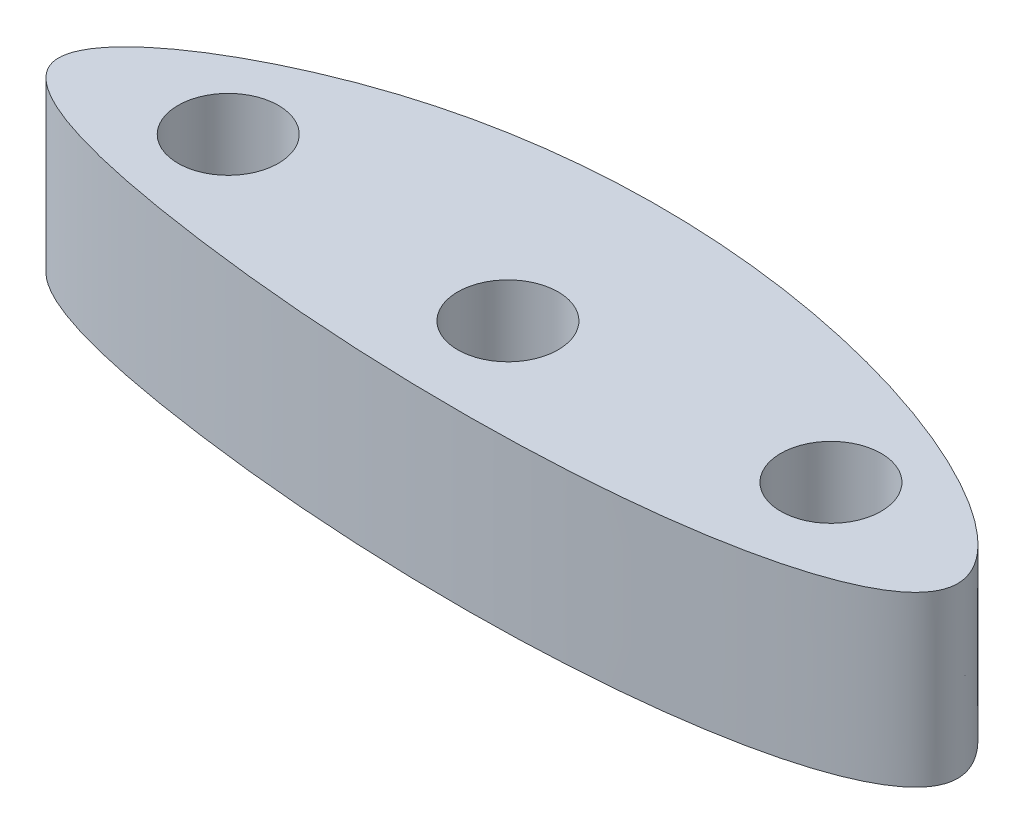
ISO-10303-21;
HEADER;
FILE_DESCRIPTION(('STEP AP214'),'2;1');
FILE_NAME('part.step','',(''),(''),'','','');
FILE_SCHEMA(('AUTOMOTIVE_DESIGN { 1 0 10303 214 1 1 1 1 }'));
ENDSEC;
DATA;
#1=APPLICATION_CONTEXT('core data for automotive mechanical design processes');
#2=APPLICATION_PROTOCOL_DEFINITION('international standard','automotive_design',2000,#1);
#3=PRODUCT_CONTEXT('',#1,'mechanical');
#4=PRODUCT('Part','Part','',(#3));
#5=PRODUCT_RELATED_PRODUCT_CATEGORY('part','',(#4));
#6=PRODUCT_DEFINITION_FORMATION('','',#4);
#7=PRODUCT_DEFINITION_CONTEXT('part definition',#1,'design');
#8=PRODUCT_DEFINITION('design','',#6,#7);
#9=PRODUCT_DEFINITION_SHAPE('','',#8);
#10=(LENGTH_UNIT() NAMED_UNIT(*) SI_UNIT(.MILLI.,.METRE.));
#11=(NAMED_UNIT(*) PLANE_ANGLE_UNIT() SI_UNIT($,.RADIAN.));
#12=(NAMED_UNIT(*) SI_UNIT($,.STERADIAN.) SOLID_ANGLE_UNIT());
#13=UNCERTAINTY_MEASURE_WITH_UNIT(LENGTH_MEASURE(1.E-05),#10,'distance_accuracy_value','');
#14=(GEOMETRIC_REPRESENTATION_CONTEXT(3) GLOBAL_UNCERTAINTY_ASSIGNED_CONTEXT((#13)) GLOBAL_UNIT_ASSIGNED_CONTEXT((#10,
#11,#12)) REPRESENTATION_CONTEXT('',''));
#15=CARTESIAN_POINT('',(0.,0.,0.));
#16=DIRECTION('',(0.,0.,1.));
#17=DIRECTION('',(1.,0.,0.));
#18=AXIS2_PLACEMENT_3D('',#15,#16,#17);
#19=CARTESIAN_POINT('',(34.7144301683943,8.4,-0.429088161329914));
#20=DIRECTION('',(0.,1.,0.));
#21=DIRECTION('',(0.,0.,1.));
#22=AXIS2_PLACEMENT_3D('',#19,#20,#21);
#23=PLANE('',#22);
#24=CARTESIAN_POINT('',(12.2418134366345,8.4,-0.164766664062107));
#25=DIRECTION('',(0.,1.,0.));
#26=DIRECTION('',(0.,0.,1.));
#27=AXIS2_PLACEMENT_3D('',#24,#25,#26);
#28=CIRCLE('',#27,2.5);
#29=CARTESIAN_POINT('',(12.2418134366345,8.39999999999999,-2.66476666406211));
#30=VERTEX_POINT('',#29);
#31=EDGE_CURVE('E55',#30,#30,#28,.T.);
#32=ORIENTED_EDGE('',*,*,#31,.F.);
#33=EDGE_LOOP('',(#32));
#34=FACE_BOUND('',#33,.T.);
#35=CARTESIAN_POINT('',(-10.2403549052846,8.4,0.));
#36=CARTESIAN_POINT('',(-9.7901955701614,8.4,1.9523160760497));
#37=CARTESIAN_POINT('',(10.2205359397792,8.4,6.78554685382735));
#38=CARTESIAN_POINT('',(53.6020693336113,8.4,2.82363610312065));
#39=CARTESIAN_POINT('',(9.0457901157086,8.4,-14.8561358803526));
#40=CARTESIAN_POINT('',(-10.7571119248499,8.4,-2.24114654077513));
#41=CARTESIAN_POINT('',(-10.2403549052846,8.4,0.));
#42=B_SPLINE_CURVE_WITH_KNOTS('',3,(#35,#36,#37,#38,#39,#40,#41),.UNSPECIFIED.,.T.,.F.,(4,1,1,1,
4),(0.,0.116417381422337,0.48851706440724,0.866359543487093,1.),.UNSPECIFIED.);
#43=CARTESIAN_POINT('',(-10.2403549052846,8.4,0.));
#44=VERTEX_POINT('',#43);
#45=EDGE_CURVE('E10',#44,#44,#42,.T.);
#46=ORIENTED_EDGE('',*,*,#45,.T.);
#47=EDGE_LOOP('',(#46));
#48=FACE_BOUND('',#47,.T.);
#49=CARTESIAN_POINT('',(-2.75818656336549,8.4,-1.24268851227782));
#50=DIRECTION('',(0.,1.,0.));
#51=DIRECTION('',(0.,0.,1.));
#52=AXIS2_PLACEMENT_3D('',#49,#50,#51);
#53=CIRCLE('',#52,2.5);
#54=CARTESIAN_POINT('',(-2.75818656336549,8.39999999999999,-3.74268851227782));
#55=VERTEX_POINT('',#54);
#56=EDGE_CURVE('E44',#55,#55,#53,.T.);
#57=ORIENTED_EDGE('',*,*,#56,.F.);
#58=EDGE_LOOP('',(#57));
#59=FACE_BOUND('',#58,.T.);
#60=CARTESIAN_POINT('',(27.2418134366345,8.4,-1.24268851227782));
#61=DIRECTION('',(0.,1.,0.));
#62=DIRECTION('',(0.,0.,1.));
#63=AXIS2_PLACEMENT_3D('',#60,#61,#62);
#64=CIRCLE('',#63,2.5);
#65=CARTESIAN_POINT('',(27.2418134366345,8.39999999999999,-3.74268851227783));
#66=VERTEX_POINT('',#65);
#67=EDGE_CURVE('E61',#66,#66,#64,.T.);
#68=ORIENTED_EDGE('',*,*,#67,.F.);
#69=EDGE_LOOP('',(#68));
#70=FACE_BOUND('',#69,.T.);
#71=ADVANCED_FACE('F31',(#34,#48,#59,#70),#23,.T.);
#72=CARTESIAN_POINT('',(34.7144301683943,0.,-0.429088161329914));
#73=DIRECTION('',(0.,1.,0.));
#74=DIRECTION('',(0.,0.,1.));
#75=AXIS2_PLACEMENT_3D('',#72,#73,#74);
#76=PLANE('',#75);
#77=CARTESIAN_POINT('',(-10.2403549052846,0.,0.));
#78=CARTESIAN_POINT('',(-9.7901955701614,0.,1.9523160760497));
#79=CARTESIAN_POINT('',(10.2205359397792,0.,6.78554685382735));
#80=CARTESIAN_POINT('',(53.6020693336113,0.,2.82363610312065));
#81=CARTESIAN_POINT('',(9.0457901157086,0.,-14.8561358803526));
#82=CARTESIAN_POINT('',(-10.7571119248499,0.,-2.24114654077513));
#83=CARTESIAN_POINT('',(-10.2403549052846,0.,0.));
#84=B_SPLINE_CURVE_WITH_KNOTS('',3,(#77,#78,#79,#80,#81,#82,#83),.UNSPECIFIED.,.T.,.F.,(4,1,1,1,
4),(0.,0.116417381422337,0.48851706440724,0.866359543487093,1.),.UNSPECIFIED.);
#85=CARTESIAN_POINT('',(-10.2403549052846,0.,0.));
#86=VERTEX_POINT('',#85);
#87=EDGE_CURVE('E36',#86,#86,#84,.T.);
#88=ORIENTED_EDGE('',*,*,#87,.F.);
#89=EDGE_LOOP('',(#88));
#90=FACE_BOUND('',#89,.T.);
#91=CARTESIAN_POINT('',(-2.75818656336549,0.,-1.24268851227782));
#92=DIRECTION('',(0.,1.,0.));
#93=DIRECTION('',(0.,0.,1.));
#94=AXIS2_PLACEMENT_3D('',#91,#92,#93);
#95=CIRCLE('',#94,2.5);
#96=CARTESIAN_POINT('',(-2.75818656336549,0.,-3.74268851227782));
#97=VERTEX_POINT('',#96);
#98=EDGE_CURVE('E49',#97,#97,#95,.T.);
#99=ORIENTED_EDGE('',*,*,#98,.T.);
#100=EDGE_LOOP('',(#99));
#101=FACE_BOUND('',#100,.T.);
#102=CARTESIAN_POINT('',(12.2418134366345,0.,-0.164766664062107));
#103=DIRECTION('',(0.,1.,0.));
#104=DIRECTION('',(0.,0.,1.));
#105=AXIS2_PLACEMENT_3D('',#102,#103,#104);
#106=CIRCLE('',#105,2.5);
#107=CARTESIAN_POINT('',(12.2418134366345,0.,-2.66476666406211));
#108=VERTEX_POINT('',#107);
#109=EDGE_CURVE('E58',#108,#108,#106,.T.);
#110=ORIENTED_EDGE('',*,*,#109,.T.);
#111=EDGE_LOOP('',(#110));
#112=FACE_BOUND('',#111,.T.);
#113=CARTESIAN_POINT('',(27.2418134366345,0.,-1.24268851227782));
#114=DIRECTION('',(0.,1.,0.));
#115=DIRECTION('',(0.,0.,1.));
#116=AXIS2_PLACEMENT_3D('',#113,#114,#115);
#117=CIRCLE('',#116,2.5);
#118=CARTESIAN_POINT('',(27.2418134366345,0.,-3.74268851227783));
#119=VERTEX_POINT('',#118);
#120=EDGE_CURVE('E64',#119,#119,#117,.T.);
#121=ORIENTED_EDGE('',*,*,#120,.T.);
#122=EDGE_LOOP('',(#121));
#123=FACE_BOUND('',#122,.T.);
#124=ADVANCED_FACE('F74',(#90,#101,#112,#123),#76,.F.);
#125=DIRECTION('',(0.,-1.,0.));
#126=VECTOR('',#125,1.);
#127=SURFACE_OF_LINEAR_EXTRUSION('',#42,#126);
#128=ORIENTED_EDGE('',*,*,#45,.F.);
#129=EDGE_LOOP('',(#128));
#130=FACE_BOUND('',#129,.T.);
#131=ORIENTED_EDGE('',*,*,#87,.T.);
#132=EDGE_LOOP('',(#131));
#133=FACE_BOUND('',#132,.T.);
#134=ADVANCED_FACE('F33',(#130,#133),#127,.F.);
#135=CARTESIAN_POINT('',(-2.75818656336549,8.4,-1.24268851227782));
#136=DIRECTION('',(0.,-1.,0.));
#137=DIRECTION('',(0.,0.,-1.));
#138=AXIS2_PLACEMENT_3D('',#135,#136,#137);
#139=CYLINDRICAL_SURFACE('',#138,2.5);
#140=CARTESIAN_POINT('',(-2.75818656336549,8.39999999999999,-3.74268851227782));
#141=CARTESIAN_POINT('',(-2.75818656336549,8.31249999999999,-3.74268851227782));
#142=CARTESIAN_POINT('',(-2.75818656336549,8.22499999999999,-3.74268851227782));
#143=CARTESIAN_POINT('',(-2.75818656336549,8.04999999999999,-3.74268851227782));
#144=CARTESIAN_POINT('',(-2.75818656336549,7.96249999999999,-3.74268851227782));
#145=CARTESIAN_POINT('',(-2.75818656336549,7.78749999999999,-3.74268851227782));
#146=CARTESIAN_POINT('',(-2.75818656336549,7.69999999999999,-3.74268851227782));
#147=CARTESIAN_POINT('',(-2.75818656336549,7.52499999999999,-3.74268851227782));
#148=CARTESIAN_POINT('',(-2.75818656336549,7.43749999999999,-3.74268851227782));
#149=CARTESIAN_POINT('',(-2.75818656336549,7.26249999999999,-3.74268851227782));
#150=CARTESIAN_POINT('',(-2.75818656336549,7.17499999999999,-3.74268851227782));
#151=CARTESIAN_POINT('',(-2.75818656336549,6.99999999999999,-3.74268851227782));
#152=CARTESIAN_POINT('',(-2.75818656336549,6.91249999999999,-3.74268851227782));
#153=CARTESIAN_POINT('',(-2.75818656336549,6.73749999999999,-3.74268851227782));
#154=CARTESIAN_POINT('',(-2.75818656336549,6.64999999999999,-3.74268851227782));
#155=CARTESIAN_POINT('',(-2.75818656336549,6.47499999999999,-3.74268851227782));
#156=CARTESIAN_POINT('',(-2.75818656336549,6.38749999999999,-3.74268851227782));
#157=CARTESIAN_POINT('',(-2.75818656336549,6.2125,-3.74268851227782));
#158=CARTESIAN_POINT('',(-2.75818656336549,6.12499999999999,-3.74268851227782));
#159=CARTESIAN_POINT('',(-2.75818656336549,5.94999999999999,-3.74268851227782));
#160=CARTESIAN_POINT('',(-2.75818656336549,5.8625,-3.74268851227782));
#161=CARTESIAN_POINT('',(-2.75818656336549,5.6875,-3.74268851227782));
#162=CARTESIAN_POINT('',(-2.75818656336549,5.59999999999999,-3.74268851227782));
#163=CARTESIAN_POINT('',(-2.75818656336549,5.42499999999999,-3.74268851227782));
#164=CARTESIAN_POINT('',(-2.75818656336549,5.3375,-3.74268851227782));
#165=CARTESIAN_POINT('',(-2.75818656336549,5.1625,-3.74268851227782));
#166=CARTESIAN_POINT('',(-2.75818656336549,5.075,-3.74268851227782));
#167=CARTESIAN_POINT('',(-2.75818656336549,4.9,-3.74268851227782));
#168=CARTESIAN_POINT('',(-2.75818656336549,4.8125,-3.74268851227782));
#169=CARTESIAN_POINT('',(-2.75818656336549,4.6375,-3.74268851227782));
#170=CARTESIAN_POINT('',(-2.75818656336549,4.55,-3.74268851227782));
#171=CARTESIAN_POINT('',(-2.75818656336549,4.375,-3.74268851227782));
#172=CARTESIAN_POINT('',(-2.75818656336549,4.2875,-3.74268851227782));
#173=CARTESIAN_POINT('',(-2.75818656336549,4.1125,-3.74268851227782));
#174=CARTESIAN_POINT('',(-2.75818656336549,4.025,-3.74268851227782));
#175=CARTESIAN_POINT('',(-2.75818656336549,3.85,-3.74268851227782));
#176=CARTESIAN_POINT('',(-2.75818656336549,3.7625,-3.74268851227782));
#177=CARTESIAN_POINT('',(-2.75818656336549,3.5875,-3.74268851227782));
#178=CARTESIAN_POINT('',(-2.75818656336549,3.5,-3.74268851227782));
#179=CARTESIAN_POINT('',(-2.75818656336549,3.325,-3.74268851227782));
#180=CARTESIAN_POINT('',(-2.75818656336549,3.2375,-3.74268851227782));
#181=CARTESIAN_POINT('',(-2.75818656336549,3.0625,-3.74268851227782));
#182=CARTESIAN_POINT('',(-2.75818656336549,2.975,-3.74268851227782));
#183=CARTESIAN_POINT('',(-2.75818656336549,2.8,-3.74268851227782));
#184=CARTESIAN_POINT('',(-2.75818656336549,2.7125,-3.74268851227782));
#185=CARTESIAN_POINT('',(-2.75818656336549,2.5375,-3.74268851227782));
#186=CARTESIAN_POINT('',(-2.75818656336549,2.45,-3.74268851227782));
#187=CARTESIAN_POINT('',(-2.75818656336549,2.275,-3.74268851227782));
#188=CARTESIAN_POINT('',(-2.75818656336549,2.1875,-3.74268851227782));
#189=CARTESIAN_POINT('',(-2.75818656336549,2.0125,-3.74268851227782));
#190=CARTESIAN_POINT('',(-2.75818656336549,1.925,-3.74268851227782));
#191=CARTESIAN_POINT('',(-2.75818656336549,1.75,-3.74268851227782));
#192=CARTESIAN_POINT('',(-2.75818656336549,1.6625,-3.74268851227782));
#193=CARTESIAN_POINT('',(-2.75818656336549,1.4875,-3.74268851227782));
#194=CARTESIAN_POINT('',(-2.75818656336549,1.4,-3.74268851227782));
#195=CARTESIAN_POINT('',(-2.75818656336549,1.225,-3.74268851227782));
#196=CARTESIAN_POINT('',(-2.75818656336549,1.1375,-3.74268851227782));
#197=CARTESIAN_POINT('',(-2.75818656336549,0.962499999999998,-3.74268851227782));
#198=CARTESIAN_POINT('',(-2.75818656336549,0.874999999999998,-3.74268851227782));
#199=CARTESIAN_POINT('',(-2.75818656336549,0.699999999999998,-3.74268851227782));
#200=CARTESIAN_POINT('',(-2.75818656336549,0.612499999999998,-3.74268851227782));
#201=CARTESIAN_POINT('',(-2.75818656336549,0.437499999999998,-3.74268851227782));
#202=CARTESIAN_POINT('',(-2.75818656336549,0.349999999999998,-3.74268851227782));
#203=CARTESIAN_POINT('',(-2.75818656336549,0.174999999999999,-3.74268851227782));
#204=CARTESIAN_POINT('',(-2.75818656336549,0.0874999999999985,-3.74268851227782));
#205=CARTESIAN_POINT('',(-2.75818656336549,0.,-3.74268851227782));
#206=B_SPLINE_CURVE_WITH_KNOTS('',3,(#140,#141,#142,#143,#144,#145,#146,#147,#148,#149,#150,
#151,#152,#153,#154,#155,#156,#157,#158,#159,#160,#161,#162,#163,#164,#165,#166,#167,#168,#169,
#170,#171,#172,#173,#174,#175,#176,#177,#178,#179,#180,#181,#182,#183,#184,#185,#186,#187,#188,
#189,#190,#191,#192,#193,#194,#195,#196,#197,#198,#199,#200,#201,#202,#203,#204,#205),
.UNSPECIFIED.,.F.,.F.,(4,2,2,2,2,2,2,2,2,2,2,2,2,2,2,2,2,2,2,2,2,2,2,2,2,2,2,2,2,2,2,2,4),(0.,
0.262499999999999,0.524999999999999,0.787499999999998,1.05,1.3125,1.575,1.8375,2.1,2.3625,2.625,
2.8875,3.15,3.4125,3.675,3.9375,4.2,4.4625,4.725,4.9875,5.25,5.5125,5.775,6.0375,
6.29999999999999,6.5625,6.82499999999999,7.0875,7.34999999999999,7.61249999999999,
7.87499999999999,8.13749999999999,8.4),.UNSPECIFIED.);
#207=EDGE_CURVE('BSEAM83',#55,#97,#206,.T.);
#208=ORIENTED_EDGE('',*,*,#56,.T.);
#209=ORIENTED_EDGE('',*,*,#98,.F.);
#210=ORIENTED_EDGE('',*,*,#207,.T.);
#211=ORIENTED_EDGE('',*,*,#207,.F.);
#212=EDGE_LOOP('',(#208,#210,#209,#211));
#213=FACE_BOUND('',#212,.T.);
#214=ADVANCED_FACE('F83',(#213),#139,.F.);
#215=CARTESIAN_POINT('',(12.2418134366345,8.4,-0.164766664062107));
#216=DIRECTION('',(0.,-1.,0.));
#217=DIRECTION('',(0.,0.,-1.));
#218=AXIS2_PLACEMENT_3D('',#215,#216,#217);
#219=CYLINDRICAL_SURFACE('',#218,2.5);
#220=CARTESIAN_POINT('',(12.2418134366345,8.39999999999999,-2.66476666406211));
#221=CARTESIAN_POINT('',(12.2418134366345,8.31249999999999,-2.66476666406211));
#222=CARTESIAN_POINT('',(12.2418134366345,8.22499999999999,-2.66476666406211));
#223=CARTESIAN_POINT('',(12.2418134366345,8.04999999999999,-2.66476666406211));
#224=CARTESIAN_POINT('',(12.2418134366345,7.96249999999999,-2.66476666406211));
#225=CARTESIAN_POINT('',(12.2418134366345,7.78749999999999,-2.66476666406211));
#226=CARTESIAN_POINT('',(12.2418134366345,7.69999999999999,-2.66476666406211));
#227=CARTESIAN_POINT('',(12.2418134366345,7.52499999999999,-2.66476666406211));
#228=CARTESIAN_POINT('',(12.2418134366345,7.43749999999999,-2.66476666406211));
#229=CARTESIAN_POINT('',(12.2418134366345,7.26249999999999,-2.66476666406211));
#230=CARTESIAN_POINT('',(12.2418134366345,7.17499999999999,-2.66476666406211));
#231=CARTESIAN_POINT('',(12.2418134366345,6.99999999999999,-2.66476666406211));
#232=CARTESIAN_POINT('',(12.2418134366345,6.91249999999999,-2.66476666406211));
#233=CARTESIAN_POINT('',(12.2418134366345,6.73749999999999,-2.66476666406211));
#234=CARTESIAN_POINT('',(12.2418134366345,6.64999999999999,-2.66476666406211));
#235=CARTESIAN_POINT('',(12.2418134366345,6.47499999999999,-2.66476666406211));
#236=CARTESIAN_POINT('',(12.2418134366345,6.38749999999999,-2.66476666406211));
#237=CARTESIAN_POINT('',(12.2418134366345,6.2125,-2.66476666406211));
#238=CARTESIAN_POINT('',(12.2418134366345,6.12499999999999,-2.66476666406211));
#239=CARTESIAN_POINT('',(12.2418134366345,5.94999999999999,-2.66476666406211));
#240=CARTESIAN_POINT('',(12.2418134366345,5.8625,-2.66476666406211));
#241=CARTESIAN_POINT('',(12.2418134366345,5.6875,-2.66476666406211));
#242=CARTESIAN_POINT('',(12.2418134366345,5.59999999999999,-2.66476666406211));
#243=CARTESIAN_POINT('',(12.2418134366345,5.42499999999999,-2.66476666406211));
#244=CARTESIAN_POINT('',(12.2418134366345,5.3375,-2.66476666406211));
#245=CARTESIAN_POINT('',(12.2418134366345,5.1625,-2.66476666406211));
#246=CARTESIAN_POINT('',(12.2418134366345,5.075,-2.66476666406211));
#247=CARTESIAN_POINT('',(12.2418134366345,4.9,-2.66476666406211));
#248=CARTESIAN_POINT('',(12.2418134366345,4.8125,-2.66476666406211));
#249=CARTESIAN_POINT('',(12.2418134366345,4.6375,-2.66476666406211));
#250=CARTESIAN_POINT('',(12.2418134366345,4.55,-2.66476666406211));
#251=CARTESIAN_POINT('',(12.2418134366345,4.375,-2.66476666406211));
#252=CARTESIAN_POINT('',(12.2418134366345,4.2875,-2.66476666406211));
#253=CARTESIAN_POINT('',(12.2418134366345,4.1125,-2.66476666406211));
#254=CARTESIAN_POINT('',(12.2418134366345,4.025,-2.66476666406211));
#255=CARTESIAN_POINT('',(12.2418134366345,3.85,-2.66476666406211));
#256=CARTESIAN_POINT('',(12.2418134366345,3.7625,-2.66476666406211));
#257=CARTESIAN_POINT('',(12.2418134366345,3.5875,-2.66476666406211));
#258=CARTESIAN_POINT('',(12.2418134366345,3.5,-2.66476666406211));
#259=CARTESIAN_POINT('',(12.2418134366345,3.325,-2.66476666406211));
#260=CARTESIAN_POINT('',(12.2418134366345,3.2375,-2.66476666406211));
#261=CARTESIAN_POINT('',(12.2418134366345,3.0625,-2.66476666406211));
#262=CARTESIAN_POINT('',(12.2418134366345,2.975,-2.66476666406211));
#263=CARTESIAN_POINT('',(12.2418134366345,2.8,-2.66476666406211));
#264=CARTESIAN_POINT('',(12.2418134366345,2.7125,-2.66476666406211));
#265=CARTESIAN_POINT('',(12.2418134366345,2.5375,-2.66476666406211));
#266=CARTESIAN_POINT('',(12.2418134366345,2.45,-2.66476666406211));
#267=CARTESIAN_POINT('',(12.2418134366345,2.275,-2.66476666406211));
#268=CARTESIAN_POINT('',(12.2418134366345,2.1875,-2.66476666406211));
#269=CARTESIAN_POINT('',(12.2418134366345,2.0125,-2.66476666406211));
#270=CARTESIAN_POINT('',(12.2418134366345,1.925,-2.66476666406211));
#271=CARTESIAN_POINT('',(12.2418134366345,1.75,-2.66476666406211));
#272=CARTESIAN_POINT('',(12.2418134366345,1.6625,-2.66476666406211));
#273=CARTESIAN_POINT('',(12.2418134366345,1.4875,-2.66476666406211));
#274=CARTESIAN_POINT('',(12.2418134366345,1.4,-2.66476666406211));
#275=CARTESIAN_POINT('',(12.2418134366345,1.225,-2.66476666406211));
#276=CARTESIAN_POINT('',(12.2418134366345,1.1375,-2.66476666406211));
#277=CARTESIAN_POINT('',(12.2418134366345,0.962499999999998,-2.66476666406211));
#278=CARTESIAN_POINT('',(12.2418134366345,0.874999999999998,-2.66476666406211));
#279=CARTESIAN_POINT('',(12.2418134366345,0.699999999999998,-2.66476666406211));
#280=CARTESIAN_POINT('',(12.2418134366345,0.612499999999998,-2.66476666406211));
#281=CARTESIAN_POINT('',(12.2418134366345,0.437499999999998,-2.66476666406211));
#282=CARTESIAN_POINT('',(12.2418134366345,0.349999999999998,-2.66476666406211));
#283=CARTESIAN_POINT('',(12.2418134366345,0.174999999999999,-2.66476666406211));
#284=CARTESIAN_POINT('',(12.2418134366345,0.0874999999999985,-2.66476666406211));
#285=CARTESIAN_POINT('',(12.2418134366345,0.,-2.66476666406211));
#286=B_SPLINE_CURVE_WITH_KNOTS('',3,(#220,#221,#222,#223,#224,#225,#226,#227,#228,#229,#230,
#231,#232,#233,#234,#235,#236,#237,#238,#239,#240,#241,#242,#243,#244,#245,#246,#247,#248,#249,
#250,#251,#252,#253,#254,#255,#256,#257,#258,#259,#260,#261,#262,#263,#264,#265,#266,#267,#268,
#269,#270,#271,#272,#273,#274,#275,#276,#277,#278,#279,#280,#281,#282,#283,#284,#285),
.UNSPECIFIED.,.F.,.F.,(4,2,2,2,2,2,2,2,2,2,2,2,2,2,2,2,2,2,2,2,2,2,2,2,2,2,2,2,2,2,2,2,4),(0.,
0.262499999999999,0.524999999999999,0.787499999999998,1.05,1.3125,1.575,1.8375,2.1,2.3625,2.625,
2.8875,3.15,3.4125,3.675,3.9375,4.2,4.4625,4.725,4.9875,5.25,5.5125,5.775,6.0375,
6.29999999999999,6.5625,6.82499999999999,7.0875,7.34999999999999,7.61249999999999,
7.87499999999999,8.13749999999999,8.4),.UNSPECIFIED.);
#287=EDGE_CURVE('BSEAM86',#30,#108,#286,.T.);
#288=ORIENTED_EDGE('',*,*,#31,.T.);
#289=ORIENTED_EDGE('',*,*,#109,.F.);
#290=ORIENTED_EDGE('',*,*,#287,.T.);
#291=ORIENTED_EDGE('',*,*,#287,.F.);
#292=EDGE_LOOP('',(#288,#290,#289,#291));
#293=FACE_BOUND('',#292,.T.);
#294=ADVANCED_FACE('F86',(#293),#219,.F.);
#295=CARTESIAN_POINT('',(27.2418134366345,8.4,-1.24268851227782));
#296=DIRECTION('',(0.,-1.,0.));
#297=DIRECTION('',(0.,0.,-1.));
#298=AXIS2_PLACEMENT_3D('',#295,#296,#297);
#299=CYLINDRICAL_SURFACE('',#298,2.5);
#300=CARTESIAN_POINT('',(27.2418134366345,8.39999999999999,-3.74268851227783));
#301=CARTESIAN_POINT('',(27.2418134366345,8.31249999999999,-3.74268851227783));
#302=CARTESIAN_POINT('',(27.2418134366345,8.22499999999999,-3.74268851227783));
#303=CARTESIAN_POINT('',(27.2418134366345,8.04999999999999,-3.74268851227783));
#304=CARTESIAN_POINT('',(27.2418134366345,7.96249999999999,-3.74268851227783));
#305=CARTESIAN_POINT('',(27.2418134366345,7.78749999999999,-3.74268851227783));
#306=CARTESIAN_POINT('',(27.2418134366345,7.69999999999999,-3.74268851227783));
#307=CARTESIAN_POINT('',(27.2418134366345,7.52499999999999,-3.74268851227783));
#308=CARTESIAN_POINT('',(27.2418134366345,7.43749999999999,-3.74268851227783));
#309=CARTESIAN_POINT('',(27.2418134366345,7.26249999999999,-3.74268851227783));
#310=CARTESIAN_POINT('',(27.2418134366345,7.17499999999999,-3.74268851227783));
#311=CARTESIAN_POINT('',(27.2418134366345,6.99999999999999,-3.74268851227783));
#312=CARTESIAN_POINT('',(27.2418134366345,6.91249999999999,-3.74268851227783));
#313=CARTESIAN_POINT('',(27.2418134366345,6.73749999999999,-3.74268851227783));
#314=CARTESIAN_POINT('',(27.2418134366345,6.64999999999999,-3.74268851227783));
#315=CARTESIAN_POINT('',(27.2418134366345,6.47499999999999,-3.74268851227783));
#316=CARTESIAN_POINT('',(27.2418134366345,6.38749999999999,-3.74268851227783));
#317=CARTESIAN_POINT('',(27.2418134366345,6.2125,-3.74268851227783));
#318=CARTESIAN_POINT('',(27.2418134366345,6.12499999999999,-3.74268851227783));
#319=CARTESIAN_POINT('',(27.2418134366345,5.94999999999999,-3.74268851227783));
#320=CARTESIAN_POINT('',(27.2418134366345,5.8625,-3.74268851227783));
#321=CARTESIAN_POINT('',(27.2418134366345,5.6875,-3.74268851227783));
#322=CARTESIAN_POINT('',(27.2418134366345,5.59999999999999,-3.74268851227783));
#323=CARTESIAN_POINT('',(27.2418134366345,5.42499999999999,-3.74268851227783));
#324=CARTESIAN_POINT('',(27.2418134366345,5.3375,-3.74268851227783));
#325=CARTESIAN_POINT('',(27.2418134366345,5.1625,-3.74268851227783));
#326=CARTESIAN_POINT('',(27.2418134366345,5.075,-3.74268851227783));
#327=CARTESIAN_POINT('',(27.2418134366345,4.9,-3.74268851227783));
#328=CARTESIAN_POINT('',(27.2418134366345,4.8125,-3.74268851227783));
#329=CARTESIAN_POINT('',(27.2418134366345,4.6375,-3.74268851227783));
#330=CARTESIAN_POINT('',(27.2418134366345,4.55,-3.74268851227783));
#331=CARTESIAN_POINT('',(27.2418134366345,4.375,-3.74268851227783));
#332=CARTESIAN_POINT('',(27.2418134366345,4.2875,-3.74268851227783));
#333=CARTESIAN_POINT('',(27.2418134366345,4.1125,-3.74268851227783));
#334=CARTESIAN_POINT('',(27.2418134366345,4.025,-3.74268851227783));
#335=CARTESIAN_POINT('',(27.2418134366345,3.85,-3.74268851227783));
#336=CARTESIAN_POINT('',(27.2418134366345,3.7625,-3.74268851227783));
#337=CARTESIAN_POINT('',(27.2418134366345,3.5875,-3.74268851227783));
#338=CARTESIAN_POINT('',(27.2418134366345,3.5,-3.74268851227783));
#339=CARTESIAN_POINT('',(27.2418134366345,3.325,-3.74268851227783));
#340=CARTESIAN_POINT('',(27.2418134366345,3.2375,-3.74268851227783));
#341=CARTESIAN_POINT('',(27.2418134366345,3.0625,-3.74268851227783));
#342=CARTESIAN_POINT('',(27.2418134366345,2.975,-3.74268851227783));
#343=CARTESIAN_POINT('',(27.2418134366345,2.8,-3.74268851227783));
#344=CARTESIAN_POINT('',(27.2418134366345,2.7125,-3.74268851227783));
#345=CARTESIAN_POINT('',(27.2418134366345,2.5375,-3.74268851227783));
#346=CARTESIAN_POINT('',(27.2418134366345,2.45,-3.74268851227783));
#347=CARTESIAN_POINT('',(27.2418134366345,2.275,-3.74268851227783));
#348=CARTESIAN_POINT('',(27.2418134366345,2.1875,-3.74268851227783));
#349=CARTESIAN_POINT('',(27.2418134366345,2.0125,-3.74268851227783));
#350=CARTESIAN_POINT('',(27.2418134366345,1.925,-3.74268851227783));
#351=CARTESIAN_POINT('',(27.2418134366345,1.75,-3.74268851227783));
#352=CARTESIAN_POINT('',(27.2418134366345,1.6625,-3.74268851227783));
#353=CARTESIAN_POINT('',(27.2418134366345,1.4875,-3.74268851227783));
#354=CARTESIAN_POINT('',(27.2418134366345,1.4,-3.74268851227783));
#355=CARTESIAN_POINT('',(27.2418134366345,1.225,-3.74268851227783));
#356=CARTESIAN_POINT('',(27.2418134366345,1.1375,-3.74268851227783));
#357=CARTESIAN_POINT('',(27.2418134366345,0.962499999999998,-3.74268851227783));
#358=CARTESIAN_POINT('',(27.2418134366345,0.874999999999998,-3.74268851227783));
#359=CARTESIAN_POINT('',(27.2418134366345,0.699999999999998,-3.74268851227783));
#360=CARTESIAN_POINT('',(27.2418134366345,0.612499999999998,-3.74268851227783));
#361=CARTESIAN_POINT('',(27.2418134366345,0.437499999999998,-3.74268851227783));
#362=CARTESIAN_POINT('',(27.2418134366345,0.349999999999998,-3.74268851227783));
#363=CARTESIAN_POINT('',(27.2418134366345,0.174999999999999,-3.74268851227783));
#364=CARTESIAN_POINT('',(27.2418134366345,0.0874999999999985,-3.74268851227783));
#365=CARTESIAN_POINT('',(27.2418134366345,0.,-3.74268851227783));
#366=B_SPLINE_CURVE_WITH_KNOTS('',3,(#300,#301,#302,#303,#304,#305,#306,#307,#308,#309,#310,
#311,#312,#313,#314,#315,#316,#317,#318,#319,#320,#321,#322,#323,#324,#325,#326,#327,#328,#329,
#330,#331,#332,#333,#334,#335,#336,#337,#338,#339,#340,#341,#342,#343,#344,#345,#346,#347,#348,
#349,#350,#351,#352,#353,#354,#355,#356,#357,#358,#359,#360,#361,#362,#363,#364,#365),
.UNSPECIFIED.,.F.,.F.,(4,2,2,2,2,2,2,2,2,2,2,2,2,2,2,2,2,2,2,2,2,2,2,2,2,2,2,2,2,2,2,2,4),(0.,
0.262499999999999,0.524999999999999,0.787499999999998,1.05,1.3125,1.575,1.8375,2.1,2.3625,2.625,
2.8875,3.15,3.4125,3.675,3.9375,4.2,4.4625,4.725,4.9875,5.25,5.5125,5.775,6.0375,
6.29999999999999,6.5625,6.82499999999999,7.0875,7.34999999999999,7.61249999999999,
7.87499999999999,8.13749999999999,8.4),.UNSPECIFIED.);
#367=EDGE_CURVE('BSEAM70',#66,#119,#366,.T.);
#368=ORIENTED_EDGE('',*,*,#67,.T.);
#369=ORIENTED_EDGE('',*,*,#120,.F.);
#370=ORIENTED_EDGE('',*,*,#367,.T.);
#371=ORIENTED_EDGE('',*,*,#367,.F.);
#372=EDGE_LOOP('',(#368,#370,#369,#371));
#373=FACE_BOUND('',#372,.T.);
#374=ADVANCED_FACE('F70',(#373),#299,.F.);
#375=CLOSED_SHELL('',(#71,#124,#134,#214,#294,#374));
#376=MANIFOLD_SOLID_BREP('B2',#375);
#377=ADVANCED_BREP_SHAPE_REPRESENTATION('',(#18,#376),#14);
#378=SHAPE_DEFINITION_REPRESENTATION(#9,#377);
ENDSEC;
END-ISO-10303-21;
